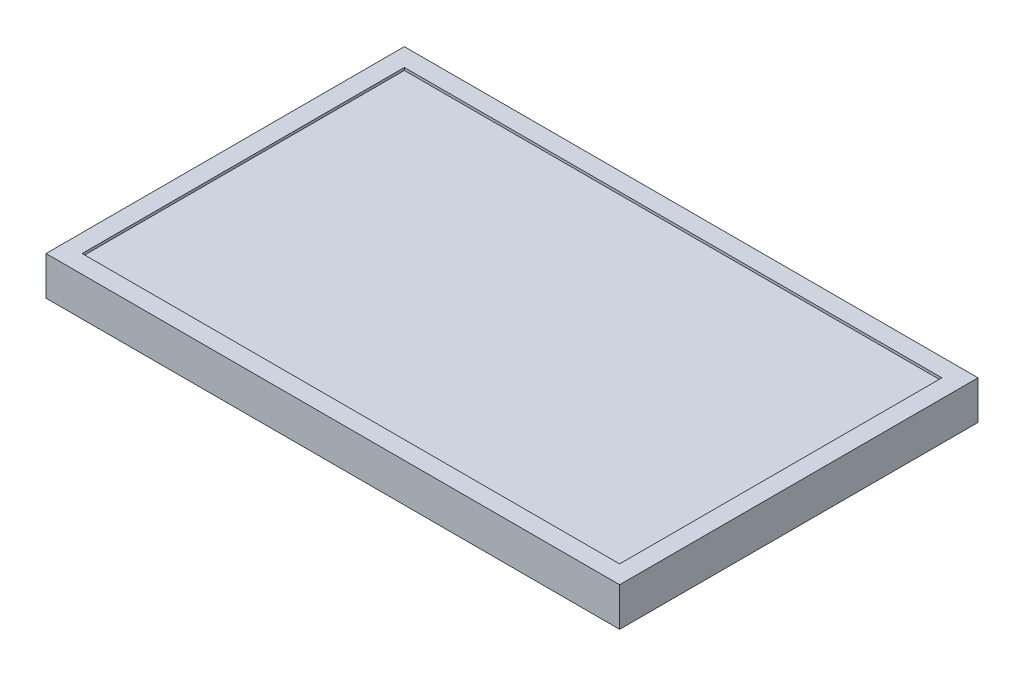
ISO-10303-21;
HEADER;
FILE_DESCRIPTION(('STEP AP214'),'2;1');
FILE_NAME('part.step','',(''),(''),'','','');
FILE_SCHEMA(('AUTOMOTIVE_DESIGN { 1 0 10303 214 1 1 1 1 }'));
ENDSEC;
DATA;
#1=APPLICATION_CONTEXT('core data for automotive mechanical design processes');
#2=APPLICATION_PROTOCOL_DEFINITION('international standard','automotive_design',2000,#1);
#3=PRODUCT_CONTEXT('',#1,'mechanical');
#4=PRODUCT('Part','Part','',(#3));
#5=PRODUCT_RELATED_PRODUCT_CATEGORY('part','',(#4));
#6=PRODUCT_DEFINITION_FORMATION('','',#4);
#7=PRODUCT_DEFINITION_CONTEXT('part definition',#1,'design');
#8=PRODUCT_DEFINITION('design','',#6,#7);
#9=PRODUCT_DEFINITION_SHAPE('','',#8);
#10=(LENGTH_UNIT() NAMED_UNIT(*) SI_UNIT(.MILLI.,.METRE.));
#11=(NAMED_UNIT(*) PLANE_ANGLE_UNIT() SI_UNIT($,.RADIAN.));
#12=(NAMED_UNIT(*) SI_UNIT($,.STERADIAN.) SOLID_ANGLE_UNIT());
#13=UNCERTAINTY_MEASURE_WITH_UNIT(LENGTH_MEASURE(1.E-05),#10,'distance_accuracy_value','');
#14=(GEOMETRIC_REPRESENTATION_CONTEXT(3) GLOBAL_UNCERTAINTY_ASSIGNED_CONTEXT((#13)) GLOBAL_UNIT_ASSIGNED_CONTEXT((#10,
#11,#12)) REPRESENTATION_CONTEXT('',''));
#15=CARTESIAN_POINT('',(0.,0.,0.));
#16=DIRECTION('',(0.,0.,1.));
#17=DIRECTION('',(1.,0.,0.));
#18=AXIS2_PLACEMENT_3D('',#15,#16,#17);
#19=CARTESIAN_POINT('',(222.5,30.,139.));
#20=DIRECTION('',(-1.,0.,0.));
#21=DIRECTION('',(0.,0.,1.));
#22=AXIS2_PLACEMENT_3D('',#19,#20,#21);
#23=PLANE('',#22);
#24=DIRECTION('',(0.,0.,-1.));
#25=VECTOR('',#24,1.);
#26=CARTESIAN_POINT('',(222.5,0.,139.));
#27=LINE('',#26,#25);
#28=CARTESIAN_POINT('',(222.5,0.,139.));
#29=VERTEX_POINT('',#28);
#30=CARTESIAN_POINT('',(222.5,0.,-139.));
#31=VERTEX_POINT('',#30);
#32=EDGE_CURVE('E140',#29,#31,#27,.T.);
#33=ORIENTED_EDGE('',*,*,#32,.T.);
#34=DIRECTION('',(0.,-1.,0.));
#35=VECTOR('',#34,1.);
#36=CARTESIAN_POINT('',(222.5,30.,-139.));
#37=LINE('',#36,#35);
#38=CARTESIAN_POINT('',(222.5,30.,-139.));
#39=VERTEX_POINT('',#38);
#40=EDGE_CURVE('E11',#39,#31,#37,.T.);
#41=ORIENTED_EDGE('',*,*,#40,.F.);
#42=DIRECTION('',(0.,0.,-1.));
#43=VECTOR('',#42,1.);
#44=CARTESIAN_POINT('',(222.5,30.,139.));
#45=LINE('',#44,#43);
#46=CARTESIAN_POINT('',(222.5,30.,139.));
#47=VERTEX_POINT('',#46);
#48=EDGE_CURVE('E144',#47,#39,#45,.T.);
#49=ORIENTED_EDGE('',*,*,#48,.F.);
#50=DIRECTION('',(0.,-1.,0.));
#51=VECTOR('',#50,1.);
#52=CARTESIAN_POINT('',(222.5,30.,139.));
#53=LINE('',#52,#51);
#54=EDGE_CURVE('E150',#47,#29,#53,.T.);
#55=ORIENTED_EDGE('',*,*,#54,.T.);
#56=EDGE_LOOP('',(#33,#41,#49,#55));
#57=FACE_BOUND('',#56,.T.);
#58=ADVANCED_FACE('F32',(#57),#23,.F.);
#59=CARTESIAN_POINT('',(-222.5,30.,-139.));
#60=DIRECTION('',(0.,0.,1.));
#61=DIRECTION('',(1.,0.,0.));
#62=AXIS2_PLACEMENT_3D('',#59,#60,#61);
#63=PLANE('',#62);
#64=DIRECTION('',(-1.,0.,0.));
#65=VECTOR('',#64,1.);
#66=CARTESIAN_POINT('',(-222.5,0.,-139.));
#67=LINE('',#66,#65);
#68=CARTESIAN_POINT('',(-222.5,0.,-139.));
#69=VERTEX_POINT('',#68);
#70=EDGE_CURVE('E153',#31,#69,#67,.T.);
#71=ORIENTED_EDGE('',*,*,#70,.T.);
#72=DIRECTION('',(0.,-1.,0.));
#73=VECTOR('',#72,1.);
#74=CARTESIAN_POINT('',(-222.5,30.,-139.));
#75=LINE('',#74,#73);
#76=CARTESIAN_POINT('',(-222.5,30.,-139.));
#77=VERTEX_POINT('',#76);
#78=EDGE_CURVE('E39',#77,#69,#75,.T.);
#79=ORIENTED_EDGE('',*,*,#78,.F.);
#80=DIRECTION('',(-1.,0.,0.));
#81=VECTOR('',#80,1.);
#82=CARTESIAN_POINT('',(-222.5,30.,-139.));
#83=LINE('',#82,#81);
#84=EDGE_CURVE('E83',#39,#77,#83,.T.);
#85=ORIENTED_EDGE('',*,*,#84,.F.);
#86=ORIENTED_EDGE('',*,*,#40,.T.);
#87=EDGE_LOOP('',(#71,#79,#85,#86));
#88=FACE_BOUND('',#87,.T.);
#89=ADVANCED_FACE('F182',(#88),#63,.F.);
#90=CARTESIAN_POINT('',(-222.5,30.,139.));
#91=DIRECTION('',(1.,0.,0.));
#92=DIRECTION('',(0.,0.,-1.));
#93=AXIS2_PLACEMENT_3D('',#90,#91,#92);
#94=PLANE('',#93);
#95=DIRECTION('',(0.,0.,1.));
#96=VECTOR('',#95,1.);
#97=CARTESIAN_POINT('',(-222.5,0.,139.));
#98=LINE('',#97,#96);
#99=CARTESIAN_POINT('',(-222.5,0.,139.));
#100=VERTEX_POINT('',#99);
#101=EDGE_CURVE('E155',#69,#100,#98,.T.);
#102=ORIENTED_EDGE('',*,*,#101,.T.);
#103=DIRECTION('',(0.,-1.,0.));
#104=VECTOR('',#103,1.);
#105=CARTESIAN_POINT('',(-222.5,30.,139.));
#106=LINE('',#105,#104);
#107=CARTESIAN_POINT('',(-222.5,30.,139.));
#108=VERTEX_POINT('',#107);
#109=EDGE_CURVE('E159',#108,#100,#106,.T.);
#110=ORIENTED_EDGE('',*,*,#109,.F.);
#111=DIRECTION('',(0.,0.,1.));
#112=VECTOR('',#111,1.);
#113=CARTESIAN_POINT('',(-222.5,30.,139.));
#114=LINE('',#113,#112);
#115=EDGE_CURVE('E147',#77,#108,#114,.T.);
#116=ORIENTED_EDGE('',*,*,#115,.F.);
#117=ORIENTED_EDGE('',*,*,#78,.T.);
#118=EDGE_LOOP('',(#102,#110,#116,#117));
#119=FACE_BOUND('',#118,.T.);
#120=ADVANCED_FACE('F164',(#119),#94,.F.);
#121=CARTESIAN_POINT('',(-222.5,30.,139.));
#122=DIRECTION('',(0.,0.,-1.));
#123=DIRECTION('',(-1.,0.,0.));
#124=AXIS2_PLACEMENT_3D('',#121,#122,#123);
#125=PLANE('',#124);
#126=DIRECTION('',(1.,0.,0.));
#127=VECTOR('',#126,1.);
#128=CARTESIAN_POINT('',(-222.5,0.,139.));
#129=LINE('',#128,#127);
#130=EDGE_CURVE('E76',#100,#29,#129,.T.);
#131=ORIENTED_EDGE('',*,*,#130,.T.);
#132=ORIENTED_EDGE('',*,*,#54,.F.);
#133=DIRECTION('',(1.,0.,0.));
#134=VECTOR('',#133,1.);
#135=CARTESIAN_POINT('',(-222.5,30.,139.));
#136=LINE('',#135,#134);
#137=EDGE_CURVE('E55',#108,#47,#136,.T.);
#138=ORIENTED_EDGE('',*,*,#137,.F.);
#139=ORIENTED_EDGE('',*,*,#109,.T.);
#140=EDGE_LOOP('',(#131,#132,#138,#139));
#141=FACE_BOUND('',#140,.T.);
#142=ADVANCED_FACE('F172',(#141),#125,.F.);
#143=CARTESIAN_POINT('',(222.5,30.,-139.));
#144=DIRECTION('',(0.,-1.,0.));
#145=DIRECTION('',(0.,0.,-1.));
#146=AXIS2_PLACEMENT_3D('',#143,#144,#145);
#147=PLANE('',#146);
#148=DIRECTION('',(0.,0.,-1.));
#149=VECTOR('',#148,1.);
#150=CARTESIAN_POINT('',(208.5,30.,125.));
#151=LINE('',#150,#149);
#152=CARTESIAN_POINT('',(208.5,30.,125.));
#153=VERTEX_POINT('',#152);
#154=CARTESIAN_POINT('',(208.5,30.,-125.));
#155=VERTEX_POINT('',#154);
#156=EDGE_CURVE('E134',#153,#155,#151,.T.);
#157=ORIENTED_EDGE('',*,*,#156,.F.);
#158=DIRECTION('',(1.,0.,0.));
#159=VECTOR('',#158,1.);
#160=CARTESIAN_POINT('',(-208.5,30.,125.));
#161=LINE('',#160,#159);
#162=CARTESIAN_POINT('',(-208.5,30.,125.));
#163=VERTEX_POINT('',#162);
#164=EDGE_CURVE('E46',#163,#153,#161,.T.);
#165=ORIENTED_EDGE('',*,*,#164,.F.);
#166=DIRECTION('',(0.,0.,1.));
#167=VECTOR('',#166,1.);
#168=CARTESIAN_POINT('',(-208.5,30.,-125.));
#169=LINE('',#168,#167);
#170=CARTESIAN_POINT('',(-208.5,30.,-125.));
#171=VERTEX_POINT('',#170);
#172=EDGE_CURVE('E125',#171,#163,#169,.T.);
#173=ORIENTED_EDGE('',*,*,#172,.F.);
#174=DIRECTION('',(-1.,0.,0.));
#175=VECTOR('',#174,1.);
#176=CARTESIAN_POINT('',(208.5,30.,-125.));
#177=LINE('',#176,#175);
#178=EDGE_CURVE('E128',#155,#171,#177,.T.);
#179=ORIENTED_EDGE('',*,*,#178,.F.);
#180=EDGE_LOOP('',(#157,#165,#173,#179));
#181=FACE_BOUND('',#180,.T.);
#182=ORIENTED_EDGE('',*,*,#48,.T.);
#183=ORIENTED_EDGE('',*,*,#84,.T.);
#184=ORIENTED_EDGE('',*,*,#115,.T.);
#185=ORIENTED_EDGE('',*,*,#137,.T.);
#186=EDGE_LOOP('',(#182,#183,#184,#185));
#187=FACE_BOUND('',#186,.T.);
#188=ADVANCED_FACE('F174',(#181,#187),#147,.F.);
#189=CARTESIAN_POINT('',(222.5,0.,-139.));
#190=DIRECTION('',(0.,-1.,0.));
#191=DIRECTION('',(0.,0.,-1.));
#192=AXIS2_PLACEMENT_3D('',#189,#190,#191);
#193=PLANE('',#192);
#194=ORIENTED_EDGE('',*,*,#32,.F.);
#195=ORIENTED_EDGE('',*,*,#130,.F.);
#196=ORIENTED_EDGE('',*,*,#101,.F.);
#197=ORIENTED_EDGE('',*,*,#70,.F.);
#198=EDGE_LOOP('',(#194,#195,#196,#197));
#199=FACE_BOUND('',#198,.T.);
#200=ADVANCED_FACE('F168',(#199),#193,.T.);
#201=CARTESIAN_POINT('',(-208.5,28.,125.));
#202=DIRECTION('',(0.,0.,1.));
#203=DIRECTION('',(1.,0.,0.));
#204=AXIS2_PLACEMENT_3D('',#201,#202,#203);
#205=PLANE('',#204);
#206=ORIENTED_EDGE('',*,*,#164,.T.);
#207=DIRECTION('',(0.,1.,0.));
#208=VECTOR('',#207,1.);
#209=CARTESIAN_POINT('',(208.5,28.,125.));
#210=LINE('',#209,#208);
#211=CARTESIAN_POINT('',(208.5,28.,125.));
#212=VERTEX_POINT('',#211);
#213=EDGE_CURVE('E103',#212,#153,#210,.T.);
#214=ORIENTED_EDGE('',*,*,#213,.F.);
#215=DIRECTION('',(1.,0.,0.));
#216=VECTOR('',#215,1.);
#217=CARTESIAN_POINT('',(-208.5,28.,125.));
#218=LINE('',#217,#216);
#219=CARTESIAN_POINT('',(-208.5,28.,125.));
#220=VERTEX_POINT('',#219);
#221=EDGE_CURVE('E107',#220,#212,#218,.T.);
#222=ORIENTED_EDGE('',*,*,#221,.F.);
#223=DIRECTION('',(0.,1.,0.));
#224=VECTOR('',#223,1.);
#225=CARTESIAN_POINT('',(-208.5,28.,125.));
#226=LINE('',#225,#224);
#227=EDGE_CURVE('E138',#220,#163,#226,.T.);
#228=ORIENTED_EDGE('',*,*,#227,.T.);
#229=EDGE_LOOP('',(#206,#214,#222,#228));
#230=FACE_BOUND('',#229,.T.);
#231=ADVANCED_FACE('F105',(#230),#205,.F.);
#232=CARTESIAN_POINT('',(-208.5,28.,-125.));
#233=DIRECTION('',(-1.,0.,0.));
#234=DIRECTION('',(0.,0.,1.));
#235=AXIS2_PLACEMENT_3D('',#232,#233,#234);
#236=PLANE('',#235);
#237=ORIENTED_EDGE('',*,*,#172,.T.);
#238=ORIENTED_EDGE('',*,*,#227,.F.);
#239=DIRECTION('',(0.,0.,1.));
#240=VECTOR('',#239,1.);
#241=CARTESIAN_POINT('',(-208.5,28.,-125.));
#242=LINE('',#241,#240);
#243=CARTESIAN_POINT('',(-208.5,28.,-125.));
#244=VERTEX_POINT('',#243);
#245=EDGE_CURVE('E113',#244,#220,#242,.T.);
#246=ORIENTED_EDGE('',*,*,#245,.F.);
#247=DIRECTION('',(0.,1.,0.));
#248=VECTOR('',#247,1.);
#249=CARTESIAN_POINT('',(-208.5,28.,-125.));
#250=LINE('',#249,#248);
#251=EDGE_CURVE('E141',#244,#171,#250,.T.);
#252=ORIENTED_EDGE('',*,*,#251,.T.);
#253=EDGE_LOOP('',(#237,#238,#246,#252));
#254=FACE_BOUND('',#253,.T.);
#255=ADVANCED_FACE('F221',(#254),#236,.F.);
#256=CARTESIAN_POINT('',(208.5,28.,-125.));
#257=DIRECTION('',(0.,0.,-1.));
#258=DIRECTION('',(-1.,0.,0.));
#259=AXIS2_PLACEMENT_3D('',#256,#257,#258);
#260=PLANE('',#259);
#261=ORIENTED_EDGE('',*,*,#178,.T.);
#262=ORIENTED_EDGE('',*,*,#251,.F.);
#263=DIRECTION('',(-1.,0.,0.));
#264=VECTOR('',#263,1.);
#265=CARTESIAN_POINT('',(208.5,28.,-125.));
#266=LINE('',#265,#264);
#267=CARTESIAN_POINT('',(208.5,28.,-125.));
#268=VERTEX_POINT('',#267);
#269=EDGE_CURVE('E121',#268,#244,#266,.T.);
#270=ORIENTED_EDGE('',*,*,#269,.F.);
#271=DIRECTION('',(0.,1.,0.));
#272=VECTOR('',#271,1.);
#273=CARTESIAN_POINT('',(208.5,28.,-125.));
#274=LINE('',#273,#272);
#275=EDGE_CURVE('E112',#268,#155,#274,.T.);
#276=ORIENTED_EDGE('',*,*,#275,.T.);
#277=EDGE_LOOP('',(#261,#262,#270,#276));
#278=FACE_BOUND('',#277,.T.);
#279=ADVANCED_FACE('F230',(#278),#260,.F.);
#280=CARTESIAN_POINT('',(208.5,28.,125.));
#281=DIRECTION('',(1.,0.,0.));
#282=DIRECTION('',(0.,0.,-1.));
#283=AXIS2_PLACEMENT_3D('',#280,#281,#282);
#284=PLANE('',#283);
#285=ORIENTED_EDGE('',*,*,#156,.T.);
#286=ORIENTED_EDGE('',*,*,#275,.F.);
#287=DIRECTION('',(0.,0.,-1.));
#288=VECTOR('',#287,1.);
#289=CARTESIAN_POINT('',(208.5,28.,125.));
#290=LINE('',#289,#288);
#291=EDGE_CURVE('E116',#212,#268,#290,.T.);
#292=ORIENTED_EDGE('',*,*,#291,.F.);
#293=ORIENTED_EDGE('',*,*,#213,.T.);
#294=EDGE_LOOP('',(#285,#286,#292,#293));
#295=FACE_BOUND('',#294,.T.);
#296=ADVANCED_FACE('F117',(#295),#284,.F.);
#297=CARTESIAN_POINT('',(208.5,28.,125.));
#298=DIRECTION('',(0.,1.,0.));
#299=DIRECTION('',(0.,0.,1.));
#300=AXIS2_PLACEMENT_3D('',#297,#298,#299);
#301=PLANE('',#300);
#302=ORIENTED_EDGE('',*,*,#221,.T.);
#303=ORIENTED_EDGE('',*,*,#291,.T.);
#304=ORIENTED_EDGE('',*,*,#269,.T.);
#305=ORIENTED_EDGE('',*,*,#245,.T.);
#306=EDGE_LOOP('',(#302,#303,#304,#305));
#307=FACE_BOUND('',#306,.T.);
#308=ADVANCED_FACE('F123',(#307),#301,.T.);
#309=CLOSED_SHELL('',(#58,#89,#120,#142,#188,#200,#231,#255,#279,#296,#308));
#310=MANIFOLD_SOLID_BREP('B2',#309);
#311=ADVANCED_BREP_SHAPE_REPRESENTATION('',(#18,#310),#14);
#312=SHAPE_DEFINITION_REPRESENTATION(#9,#311);
ENDSEC;
END-ISO-10303-21;
